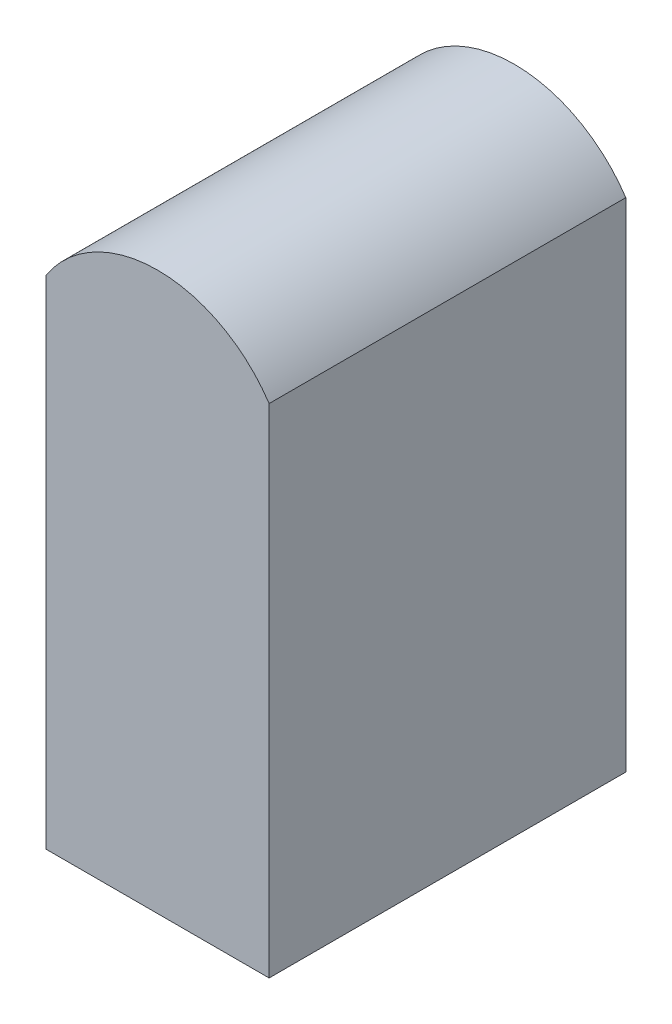
ISO-10303-21;
HEADER;
FILE_DESCRIPTION(('STEP AP214'),'2;1');
FILE_NAME('part.step','',(''),(''),'','','');
FILE_SCHEMA(('AUTOMOTIVE_DESIGN { 1 0 10303 214 1 1 1 1 }'));
ENDSEC;
DATA;
#1=APPLICATION_CONTEXT('core data for automotive mechanical design processes');
#2=APPLICATION_PROTOCOL_DEFINITION('international standard','automotive_design',2000,#1);
#3=PRODUCT_CONTEXT('',#1,'mechanical');
#4=PRODUCT('Part','Part','',(#3));
#5=PRODUCT_RELATED_PRODUCT_CATEGORY('part','',(#4));
#6=PRODUCT_DEFINITION_FORMATION('','',#4);
#7=PRODUCT_DEFINITION_CONTEXT('part definition',#1,'design');
#8=PRODUCT_DEFINITION('design','',#6,#7);
#9=PRODUCT_DEFINITION_SHAPE('','',#8);
#10=(LENGTH_UNIT() NAMED_UNIT(*) SI_UNIT(.MILLI.,.METRE.));
#11=(NAMED_UNIT(*) PLANE_ANGLE_UNIT() SI_UNIT($,.RADIAN.));
#12=(NAMED_UNIT(*) SI_UNIT($,.STERADIAN.) SOLID_ANGLE_UNIT());
#13=UNCERTAINTY_MEASURE_WITH_UNIT(LENGTH_MEASURE(1.E-05),#10,'distance_accuracy_value','');
#14=(GEOMETRIC_REPRESENTATION_CONTEXT(3) GLOBAL_UNCERTAINTY_ASSIGNED_CONTEXT((#13)) GLOBAL_UNIT_ASSIGNED_CONTEXT((#10,
#11,#12)) REPRESENTATION_CONTEXT('',''));
#15=CARTESIAN_POINT('',(0.,0.,0.));
#16=DIRECTION('',(0.,0.,1.));
#17=DIRECTION('',(1.,0.,0.));
#18=AXIS2_PLACEMENT_3D('',#15,#16,#17);
#19=CARTESIAN_POINT('',(-1.,0.,1.6));
#20=DIRECTION('',(1.,0.,0.));
#21=DIRECTION('',(0.,1.,0.));
#22=AXIS2_PLACEMENT_3D('',#19,#20,#21);
#23=PLANE('',#22);
#24=DIRECTION('',(0.,-1.,0.));
#25=VECTOR('',#24,1.);
#26=CARTESIAN_POINT('',(-1.,0.,1.6));
#27=LINE('',#26,#25);
#28=CARTESIAN_POINT('',(-1.,-0.536675041928922,1.6));
#29=VERTEX_POINT('',#28);
#30=CARTESIAN_POINT('',(-1.,-5.,1.6));
#31=VERTEX_POINT('',#30);
#32=EDGE_CURVE('E73',#29,#31,#27,.T.);
#33=ORIENTED_EDGE('',*,*,#32,.F.);
#34=DIRECTION('',(0.,0.,1.));
#35=VECTOR('',#34,1.);
#36=CARTESIAN_POINT('',(-1.,-0.536675041928922,-1.6));
#37=LINE('',#36,#35);
#38=CARTESIAN_POINT('',(-1.,-0.536675041928922,-1.6));
#39=VERTEX_POINT('',#38);
#40=EDGE_CURVE('E57',#39,#29,#37,.T.);
#41=ORIENTED_EDGE('',*,*,#40,.F.);
#42=DIRECTION('',(0.,-1.,0.));
#43=VECTOR('',#42,1.);
#44=CARTESIAN_POINT('',(-1.,0.,-1.6));
#45=LINE('',#44,#43);
#46=CARTESIAN_POINT('',(-1.,-5.,-1.6));
#47=VERTEX_POINT('',#46);
#48=EDGE_CURVE('E84',#39,#47,#45,.T.);
#49=ORIENTED_EDGE('',*,*,#48,.T.);
#50=DIRECTION('',(0.,0.,-1.));
#51=VECTOR('',#50,1.);
#52=CARTESIAN_POINT('',(-1.,-5.,1.6));
#53=LINE('',#52,#51);
#54=EDGE_CURVE('E23',#31,#47,#53,.T.);
#55=ORIENTED_EDGE('',*,*,#54,.F.);
#56=EDGE_LOOP('',(#33,#41,#49,#55));
#57=FACE_BOUND('',#56,.T.);
#58=ADVANCED_FACE('F16',(#57),#23,.F.);
#59=CARTESIAN_POINT('',(-1.,-5.,1.6));
#60=DIRECTION('',(0.,1.,0.));
#61=DIRECTION('',(0.,0.,1.));
#62=AXIS2_PLACEMENT_3D('',#59,#60,#61);
#63=PLANE('',#62);
#64=DIRECTION('',(1.,0.,0.));
#65=VECTOR('',#64,1.);
#66=CARTESIAN_POINT('',(-1.,-5.,-1.6));
#67=LINE('',#66,#65);
#68=CARTESIAN_POINT('',(1.,-5.,-1.6));
#69=VERTEX_POINT('',#68);
#70=EDGE_CURVE('E81',#47,#69,#67,.T.);
#71=ORIENTED_EDGE('',*,*,#70,.T.);
#72=DIRECTION('',(0.,0.,-1.));
#73=VECTOR('',#72,1.);
#74=CARTESIAN_POINT('',(1.,-5.,1.6));
#75=LINE('',#74,#73);
#76=CARTESIAN_POINT('',(1.,-5.,1.6));
#77=VERTEX_POINT('',#76);
#78=EDGE_CURVE('E70',#77,#69,#75,.T.);
#79=ORIENTED_EDGE('',*,*,#78,.F.);
#80=DIRECTION('',(1.,0.,0.));
#81=VECTOR('',#80,1.);
#82=CARTESIAN_POINT('',(-1.,-5.,1.6));
#83=LINE('',#82,#81);
#84=EDGE_CURVE('E37',#31,#77,#83,.T.);
#85=ORIENTED_EDGE('',*,*,#84,.F.);
#86=ORIENTED_EDGE('',*,*,#54,.T.);
#87=EDGE_LOOP('',(#71,#79,#85,#86));
#88=FACE_BOUND('',#87,.T.);
#89=ADVANCED_FACE('F79',(#88),#63,.F.);
#90=CARTESIAN_POINT('',(1.,0.,1.6));
#91=DIRECTION('',(-1.,0.,0.));
#92=DIRECTION('',(0.,-1.,0.));
#93=AXIS2_PLACEMENT_3D('',#90,#91,#92);
#94=PLANE('',#93);
#95=DIRECTION('',(0.,1.,0.));
#96=VECTOR('',#95,1.);
#97=CARTESIAN_POINT('',(1.,0.,-1.6));
#98=LINE('',#97,#96);
#99=CARTESIAN_POINT('',(1.,-0.536675041928922,-1.6));
#100=VERTEX_POINT('',#99);
#101=EDGE_CURVE('E67',#69,#100,#98,.T.);
#102=ORIENTED_EDGE('',*,*,#101,.T.);
#103=DIRECTION('',(0.,0.,1.));
#104=VECTOR('',#103,1.);
#105=CARTESIAN_POINT('',(1.,-0.536675041928922,-1.6));
#106=LINE('',#105,#104);
#107=CARTESIAN_POINT('',(1.,-0.536675041928922,1.6));
#108=VERTEX_POINT('',#107);
#109=EDGE_CURVE('E30',#100,#108,#106,.T.);
#110=ORIENTED_EDGE('',*,*,#109,.T.);
#111=DIRECTION('',(0.,1.,0.));
#112=VECTOR('',#111,1.);
#113=CARTESIAN_POINT('',(1.,0.,1.6));
#114=LINE('',#113,#112);
#115=EDGE_CURVE('E65',#77,#108,#114,.T.);
#116=ORIENTED_EDGE('',*,*,#115,.F.);
#117=ORIENTED_EDGE('',*,*,#78,.T.);
#118=EDGE_LOOP('',(#102,#110,#116,#117));
#119=FACE_BOUND('',#118,.T.);
#120=ADVANCED_FACE('F63',(#119),#94,.F.);
#121=CARTESIAN_POINT('',(-1.,-5.,1.6));
#122=DIRECTION('',(0.,0.,1.));
#123=DIRECTION('',(1.,0.,0.));
#124=AXIS2_PLACEMENT_3D('',#121,#122,#123);
#125=PLANE('',#124);
#126=CARTESIAN_POINT('',(0.,-1.2,1.6));
#127=DIRECTION('',(0.,0.,-1.));
#128=DIRECTION('',(-1.,0.,0.));
#129=AXIS2_PLACEMENT_3D('',#126,#127,#128);
#130=CIRCLE('',#129,1.2);
#131=EDGE_CURVE('E54',#29,#108,#130,.T.);
#132=ORIENTED_EDGE('',*,*,#131,.F.);
#133=ORIENTED_EDGE('',*,*,#32,.T.);
#134=ORIENTED_EDGE('',*,*,#84,.T.);
#135=ORIENTED_EDGE('',*,*,#115,.T.);
#136=EDGE_LOOP('',(#132,#133,#134,#135));
#137=FACE_BOUND('',#136,.T.);
#138=ADVANCED_FACE('F69',(#137),#125,.T.);
#139=CARTESIAN_POINT('',(-1.,-5.,-1.6));
#140=DIRECTION('',(0.,0.,1.));
#141=DIRECTION('',(1.,0.,0.));
#142=AXIS2_PLACEMENT_3D('',#139,#140,#141);
#143=PLANE('',#142);
#144=ORIENTED_EDGE('',*,*,#48,.F.);
#145=CARTESIAN_POINT('',(0.,-1.2,-1.6));
#146=DIRECTION('',(0.,0.,1.));
#147=DIRECTION('',(1.,0.,0.));
#148=AXIS2_PLACEMENT_3D('',#145,#146,#147);
#149=CIRCLE('',#148,1.2);
#150=EDGE_CURVE('E11',#39,#100,#149,.F.);
#151=ORIENTED_EDGE('',*,*,#150,.T.);
#152=ORIENTED_EDGE('',*,*,#101,.F.);
#153=ORIENTED_EDGE('',*,*,#70,.F.);
#154=EDGE_LOOP('',(#144,#151,#152,#153));
#155=FACE_BOUND('',#154,.T.);
#156=ADVANCED_FACE('F87',(#155),#143,.F.);
#157=CARTESIAN_POINT('',(0.,-1.2,-1.6));
#158=DIRECTION('',(0.,0.,1.));
#159=DIRECTION('',(1.,0.,0.));
#160=AXIS2_PLACEMENT_3D('',#157,#158,#159);
#161=CYLINDRICAL_SURFACE('',#160,1.2);
#162=ORIENTED_EDGE('',*,*,#131,.T.);
#163=ORIENTED_EDGE('',*,*,#109,.F.);
#164=ORIENTED_EDGE('',*,*,#150,.F.);
#165=ORIENTED_EDGE('',*,*,#40,.T.);
#166=EDGE_LOOP('',(#162,#163,#164,#165));
#167=FACE_BOUND('',#166,.T.);
#168=ADVANCED_FACE('F55',(#167),#161,.T.);
#169=CLOSED_SHELL('',(#58,#89,#120,#138,#156,#168));
#170=MANIFOLD_SOLID_BREP('B1',#169);
#171=ADVANCED_BREP_SHAPE_REPRESENTATION('',(#18,#170),#14);
#172=SHAPE_DEFINITION_REPRESENTATION(#9,#171);
ENDSEC;
END-ISO-10303-21;
